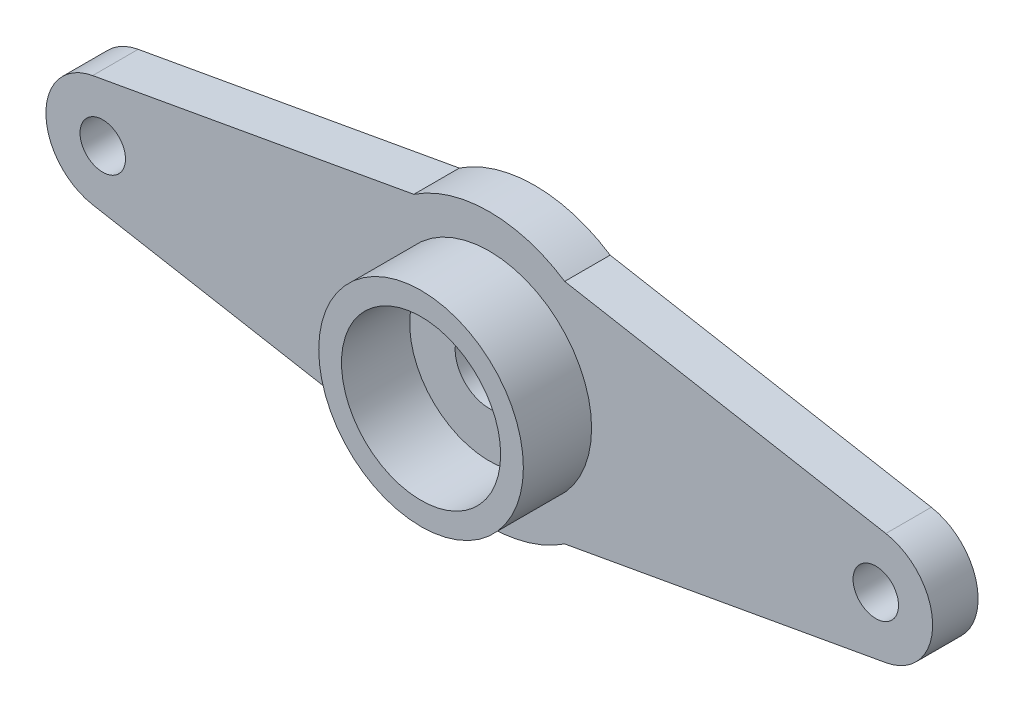
ISO-10303-21;
HEADER;
FILE_DESCRIPTION(('STEP AP214'),'2;1');
FILE_NAME('part.step','',(''),(''),'','','');
FILE_SCHEMA(('AUTOMOTIVE_DESIGN { 1 0 10303 214 1 1 1 1 }'));
ENDSEC;
DATA;
#1=APPLICATION_CONTEXT('core data for automotive mechanical design processes');
#2=APPLICATION_PROTOCOL_DEFINITION('international standard','automotive_design',2000,#1);
#3=PRODUCT_CONTEXT('',#1,'mechanical');
#4=PRODUCT('Part','Part','',(#3));
#5=PRODUCT_RELATED_PRODUCT_CATEGORY('part','',(#4));
#6=PRODUCT_DEFINITION_FORMATION('','',#4);
#7=PRODUCT_DEFINITION_CONTEXT('part definition',#1,'design');
#8=PRODUCT_DEFINITION('design','',#6,#7);
#9=PRODUCT_DEFINITION_SHAPE('','',#8);
#10=(LENGTH_UNIT() NAMED_UNIT(*) SI_UNIT(.MILLI.,.METRE.));
#11=(NAMED_UNIT(*) PLANE_ANGLE_UNIT() SI_UNIT($,.RADIAN.));
#12=(NAMED_UNIT(*) SI_UNIT($,.STERADIAN.) SOLID_ANGLE_UNIT());
#13=UNCERTAINTY_MEASURE_WITH_UNIT(LENGTH_MEASURE(1.E-05),#10,'distance_accuracy_value','');
#14=(GEOMETRIC_REPRESENTATION_CONTEXT(3) GLOBAL_UNCERTAINTY_ASSIGNED_CONTEXT((#13)) GLOBAL_UNIT_ASSIGNED_CONTEXT((#10,
#11,#12)) REPRESENTATION_CONTEXT('',''));
#15=CARTESIAN_POINT('',(0.,0.,0.));
#16=DIRECTION('',(0.,0.,1.));
#17=DIRECTION('',(1.,0.,0.));
#18=AXIS2_PLACEMENT_3D('',#15,#16,#17);
#19=CARTESIAN_POINT('',(-17.,0.,2.));
#20=DIRECTION('',(0.,0.,1.));
#21=DIRECTION('',(1.,0.,0.));
#22=AXIS2_PLACEMENT_3D('',#19,#20,#21);
#23=PLANE('',#22);
#24=CARTESIAN_POINT('',(0.,0.,2.));
#25=DIRECTION('',(0.,0.,1.));
#26=DIRECTION('',(1.,0.,0.));
#27=AXIS2_PLACEMENT_3D('',#24,#25,#26);
#28=CIRCLE('',#27,1.5);
#29=CARTESIAN_POINT('',(1.5,0.,2.));
#30=VERTEX_POINT('',#29);
#31=EDGE_CURVE('E139',#30,#30,#28,.T.);
#32=ORIENTED_EDGE('',*,*,#31,.F.);
#33=EDGE_LOOP('',(#32));
#34=FACE_BOUND('',#33,.T.);
#35=CARTESIAN_POINT('',(0.,0.,2.));
#36=DIRECTION('',(0.,0.,1.));
#37=DIRECTION('',(1.,0.,0.));
#38=AXIS2_PLACEMENT_3D('',#35,#36,#37);
#39=CIRCLE('',#38,3.5);
#40=CARTESIAN_POINT('',(3.5,0.,2.));
#41=VERTEX_POINT('',#40);
#42=EDGE_CURVE('E11',#41,#41,#39,.F.);
#43=ORIENTED_EDGE('',*,*,#42,.F.);
#44=EDGE_LOOP('',(#43));
#45=FACE_BOUND('',#44,.T.);
#46=ADVANCED_FACE('F37',(#34,#45),#23,.T.);
#47=CARTESIAN_POINT('',(-17.,0.,2.));
#48=DIRECTION('',(0.,0.,1.));
#49=DIRECTION('',(1.,0.,0.));
#50=AXIS2_PLACEMENT_3D('',#47,#48,#49);
#51=CIRCLE('',#50,1.);
#52=CARTESIAN_POINT('',(-16.,0.,2.));
#53=VERTEX_POINT('',#52);
#54=EDGE_CURVE('E209',#53,#53,#51,.T.);
#55=ORIENTED_EDGE('',*,*,#54,.F.);
#56=EDGE_LOOP('',(#55));
#57=FACE_BOUND('',#56,.T.);
#58=CARTESIAN_POINT('',(17.,0.,2.));
#59=DIRECTION('',(0.,0.,1.));
#60=DIRECTION('',(1.,0.,0.));
#61=AXIS2_PLACEMENT_3D('',#58,#59,#60);
#62=CIRCLE('',#61,1.);
#63=CARTESIAN_POINT('',(18.,0.,2.));
#64=VERTEX_POINT('',#63);
#65=EDGE_CURVE('E206',#64,#64,#62,.T.);
#66=ORIENTED_EDGE('',*,*,#65,.F.);
#67=EDGE_LOOP('',(#66));
#68=FACE_BOUND('',#67,.T.);
#69=CARTESIAN_POINT('',(0.,0.,2.));
#70=DIRECTION('',(0.,0.,1.));
#71=DIRECTION('',(1.,0.,0.));
#72=AXIS2_PLACEMENT_3D('',#69,#70,#71);
#73=CIRCLE('',#72,4.5);
#74=CARTESIAN_POINT('',(4.5,0.,2.));
#75=VERTEX_POINT('',#74);
#76=EDGE_CURVE('E194',#75,#75,#73,.T.);
#77=ORIENTED_EDGE('',*,*,#76,.F.);
#78=EDGE_LOOP('',(#77));
#79=FACE_BOUND('',#78,.T.);
#80=CARTESIAN_POINT('',(-17.,0.,2.));
#81=DIRECTION('',(0.,0.,1.));
#82=DIRECTION('',(1.,0.,0.));
#83=AXIS2_PLACEMENT_3D('',#80,#81,#82);
#84=CIRCLE('',#83,2.5);
#85=CARTESIAN_POINT('',(-17.4423451636049,2.46055496915541,2.));
#86=VERTEX_POINT('',#85);
#87=CARTESIAN_POINT('',(-17.4423451636049,-2.46055496915541,2.));
#88=VERTEX_POINT('',#87);
#89=EDGE_CURVE('E150',#86,#88,#84,.T.);
#90=ORIENTED_EDGE('',*,*,#89,.T.);
#91=DIRECTION('',(0.984221987662164,-0.176938065441948,0.));
#92=VECTOR('',#91,1.);
#93=CARTESIAN_POINT('',(-17.4423451636049,-2.46055496915541,2.));
#94=LINE('',#93,#92);
#95=CARTESIAN_POINT('',(-3.3166247903554,-5.,2.));
#96=VERTEX_POINT('',#95);
#97=EDGE_CURVE('E98',#88,#96,#94,.T.);
#98=ORIENTED_EDGE('',*,*,#97,.T.);
#99=CARTESIAN_POINT('',(0.,0.,2.));
#100=DIRECTION('',(0.,0.,1.));
#101=DIRECTION('',(1.,0.,0.));
#102=AXIS2_PLACEMENT_3D('',#99,#100,#101);
#103=CIRCLE('',#102,6.);
#104=CARTESIAN_POINT('',(3.3166247903554,-5.,2.));
#105=VERTEX_POINT('',#104);
#106=EDGE_CURVE('E182',#96,#105,#103,.T.);
#107=ORIENTED_EDGE('',*,*,#106,.T.);
#108=DIRECTION('',(0.984221987662164,0.176938065441948,0.));
#109=VECTOR('',#108,1.);
#110=CARTESIAN_POINT('',(3.3166247903554,-5.,2.));
#111=LINE('',#110,#109);
#112=CARTESIAN_POINT('',(17.4423451636049,-2.4605549691554,2.));
#113=VERTEX_POINT('',#112);
#114=EDGE_CURVE('E181',#105,#113,#111,.T.);
#115=ORIENTED_EDGE('',*,*,#114,.T.);
#116=CARTESIAN_POINT('',(17.,0.,2.));
#117=DIRECTION('',(0.,0.,1.));
#118=DIRECTION('',(1.,0.,0.));
#119=AXIS2_PLACEMENT_3D('',#116,#117,#118);
#120=CIRCLE('',#119,2.5);
#121=CARTESIAN_POINT('',(17.4423451636049,2.46055496915541,2.));
#122=VERTEX_POINT('',#121);
#123=EDGE_CURVE('E117',#113,#122,#120,.T.);
#124=ORIENTED_EDGE('',*,*,#123,.T.);
#125=DIRECTION('',(-0.984221987662164,0.176938065441948,0.));
#126=VECTOR('',#125,1.);
#127=CARTESIAN_POINT('',(17.4423451636049,2.46055496915541,2.));
#128=LINE('',#127,#126);
#129=CARTESIAN_POINT('',(3.3166247903554,5.,2.));
#130=VERTEX_POINT('',#129);
#131=EDGE_CURVE('E111',#122,#130,#128,.T.);
#132=ORIENTED_EDGE('',*,*,#131,.T.);
#133=CARTESIAN_POINT('',(0.,0.,2.));
#134=DIRECTION('',(0.,0.,1.));
#135=DIRECTION('',(1.,0.,0.));
#136=AXIS2_PLACEMENT_3D('',#133,#134,#135);
#137=CIRCLE('',#136,6.);
#138=CARTESIAN_POINT('',(-3.3166247903554,5.,2.));
#139=VERTEX_POINT('',#138);
#140=EDGE_CURVE('E115',#130,#139,#137,.T.);
#141=ORIENTED_EDGE('',*,*,#140,.T.);
#142=DIRECTION('',(-0.984221987662164,-0.176938065441948,0.));
#143=VECTOR('',#142,1.);
#144=CARTESIAN_POINT('',(-17.4423451636049,2.46055496915541,2.));
#145=LINE('',#144,#143);
#146=EDGE_CURVE('E54',#139,#86,#145,.T.);
#147=ORIENTED_EDGE('',*,*,#146,.T.);
#148=EDGE_LOOP('',(#90,#98,#107,#115,#124,#132,#141,#147));
#149=FACE_BOUND('',#148,.T.);
#150=ADVANCED_FACE('F113',(#57,#68,#79,#149),#23,.T.);
#151=CARTESIAN_POINT('',(-17.,0.,0.));
#152=DIRECTION('',(0.,0.,1.));
#153=DIRECTION('',(1.,0.,0.));
#154=AXIS2_PLACEMENT_3D('',#151,#152,#153);
#155=PLANE('',#154);
#156=CARTESIAN_POINT('',(-17.,0.,0.));
#157=DIRECTION('',(0.,0.,1.));
#158=DIRECTION('',(1.,0.,0.));
#159=AXIS2_PLACEMENT_3D('',#156,#157,#158);
#160=CIRCLE('',#159,1.);
#161=CARTESIAN_POINT('',(-16.,0.,0.));
#162=VERTEX_POINT('',#161);
#163=EDGE_CURVE('E202',#162,#162,#160,.T.);
#164=ORIENTED_EDGE('',*,*,#163,.T.);
#165=EDGE_LOOP('',(#164));
#166=FACE_BOUND('',#165,.T.);
#167=CARTESIAN_POINT('',(17.,0.,0.));
#168=DIRECTION('',(0.,0.,1.));
#169=DIRECTION('',(1.,0.,0.));
#170=AXIS2_PLACEMENT_3D('',#167,#168,#169);
#171=CIRCLE('',#170,1.);
#172=CARTESIAN_POINT('',(18.,0.,0.));
#173=VERTEX_POINT('',#172);
#174=EDGE_CURVE('E203',#173,#173,#171,.T.);
#175=ORIENTED_EDGE('',*,*,#174,.T.);
#176=EDGE_LOOP('',(#175));
#177=FACE_BOUND('',#176,.T.);
#178=CARTESIAN_POINT('',(-17.,0.,0.));
#179=DIRECTION('',(0.,0.,1.));
#180=DIRECTION('',(1.,0.,0.));
#181=AXIS2_PLACEMENT_3D('',#178,#179,#180);
#182=CIRCLE('',#181,2.5);
#183=CARTESIAN_POINT('',(-17.4423451636049,2.46055496915541,0.));
#184=VERTEX_POINT('',#183);
#185=CARTESIAN_POINT('',(-17.4423451636049,-2.46055496915541,0.));
#186=VERTEX_POINT('',#185);
#187=EDGE_CURVE('E135',#184,#186,#182,.T.);
#188=ORIENTED_EDGE('',*,*,#187,.F.);
#189=DIRECTION('',(-0.984221987662164,-0.176938065441948,0.));
#190=VECTOR('',#189,1.);
#191=CARTESIAN_POINT('',(-17.4423451636049,2.46055496915541,0.));
#192=LINE('',#191,#190);
#193=CARTESIAN_POINT('',(-3.3166247903554,5.,0.));
#194=VERTEX_POINT('',#193);
#195=EDGE_CURVE('E89',#194,#184,#192,.T.);
#196=ORIENTED_EDGE('',*,*,#195,.F.);
#197=CARTESIAN_POINT('',(0.,0.,0.));
#198=DIRECTION('',(0.,0.,1.));
#199=DIRECTION('',(1.,0.,0.));
#200=AXIS2_PLACEMENT_3D('',#197,#198,#199);
#201=CIRCLE('',#200,6.);
#202=CARTESIAN_POINT('',(3.3166247903554,5.,0.));
#203=VERTEX_POINT('',#202);
#204=EDGE_CURVE('E83',#203,#194,#201,.T.);
#205=ORIENTED_EDGE('',*,*,#204,.F.);
#206=DIRECTION('',(-0.984221987662164,0.176938065441948,0.));
#207=VECTOR('',#206,1.);
#208=CARTESIAN_POINT('',(17.4423451636049,2.46055496915541,0.));
#209=LINE('',#208,#207);
#210=CARTESIAN_POINT('',(17.4423451636049,2.46055496915541,0.));
#211=VERTEX_POINT('',#210);
#212=EDGE_CURVE('E125',#211,#203,#209,.T.);
#213=ORIENTED_EDGE('',*,*,#212,.F.);
#214=CARTESIAN_POINT('',(17.,0.,0.));
#215=DIRECTION('',(0.,0.,1.));
#216=DIRECTION('',(1.,0.,0.));
#217=AXIS2_PLACEMENT_3D('',#214,#215,#216);
#218=CIRCLE('',#217,2.5);
#219=CARTESIAN_POINT('',(17.4423451636049,-2.4605549691554,0.));
#220=VERTEX_POINT('',#219);
#221=EDGE_CURVE('E145',#220,#211,#218,.T.);
#222=ORIENTED_EDGE('',*,*,#221,.F.);
#223=DIRECTION('',(0.984221987662164,0.176938065441948,0.));
#224=VECTOR('',#223,1.);
#225=CARTESIAN_POINT('',(3.3166247903554,-5.,0.));
#226=LINE('',#225,#224);
#227=CARTESIAN_POINT('',(3.3166247903554,-5.,0.));
#228=VERTEX_POINT('',#227);
#229=EDGE_CURVE('E143',#228,#220,#226,.T.);
#230=ORIENTED_EDGE('',*,*,#229,.F.);
#231=CARTESIAN_POINT('',(0.,0.,0.));
#232=DIRECTION('',(0.,0.,1.));
#233=DIRECTION('',(1.,0.,0.));
#234=AXIS2_PLACEMENT_3D('',#231,#232,#233);
#235=CIRCLE('',#234,6.);
#236=CARTESIAN_POINT('',(-3.3166247903554,-5.,0.));
#237=VERTEX_POINT('',#236);
#238=EDGE_CURVE('E141',#237,#228,#235,.T.);
#239=ORIENTED_EDGE('',*,*,#238,.F.);
#240=DIRECTION('',(0.984221987662164,-0.176938065441948,0.));
#241=VECTOR('',#240,1.);
#242=CARTESIAN_POINT('',(-17.4423451636049,-2.46055496915541,0.));
#243=LINE('',#242,#241);
#244=EDGE_CURVE('E138',#186,#237,#243,.T.);
#245=ORIENTED_EDGE('',*,*,#244,.F.);
#246=EDGE_LOOP('',(#188,#196,#205,#213,#222,#230,#239,#245));
#247=FACE_BOUND('',#246,.T.);
#248=CARTESIAN_POINT('',(0.,0.,0.));
#249=DIRECTION('',(0.,0.,1.));
#250=DIRECTION('',(1.,0.,0.));
#251=AXIS2_PLACEMENT_3D('',#248,#249,#250);
#252=CIRCLE('',#251,1.5);
#253=CARTESIAN_POINT('',(1.5,0.,0.));
#254=VERTEX_POINT('',#253);
#255=EDGE_CURVE('E188',#254,#254,#252,.T.);
#256=ORIENTED_EDGE('',*,*,#255,.T.);
#257=EDGE_LOOP('',(#256));
#258=FACE_BOUND('',#257,.T.);
#259=ADVANCED_FACE('F168',(#166,#177,#247,#258),#155,.F.);
#260=CARTESIAN_POINT('',(-17.,0.,2.));
#261=DIRECTION('',(0.,0.,-1.));
#262=DIRECTION('',(-1.,0.,0.));
#263=AXIS2_PLACEMENT_3D('',#260,#261,#262);
#264=CYLINDRICAL_SURFACE('',#263,2.5);
#265=ORIENTED_EDGE('',*,*,#187,.T.);
#266=DIRECTION('',(0.,0.,-1.));
#267=VECTOR('',#266,1.);
#268=CARTESIAN_POINT('',(-17.4423451636049,-2.46055496915541,2.));
#269=LINE('',#268,#267);
#270=EDGE_CURVE('E46',#88,#186,#269,.T.);
#271=ORIENTED_EDGE('',*,*,#270,.F.);
#272=ORIENTED_EDGE('',*,*,#89,.F.);
#273=DIRECTION('',(0.,0.,-1.));
#274=VECTOR('',#273,1.);
#275=CARTESIAN_POINT('',(-17.4423451636049,2.46055496915541,2.));
#276=LINE('',#275,#274);
#277=EDGE_CURVE('E131',#86,#184,#276,.T.);
#278=ORIENTED_EDGE('',*,*,#277,.T.);
#279=EDGE_LOOP('',(#265,#271,#272,#278));
#280=FACE_BOUND('',#279,.T.);
#281=ADVANCED_FACE('F39',(#280),#264,.T.);
#282=CARTESIAN_POINT('',(-17.4423451636049,-2.46055496915541,2.));
#283=DIRECTION('',(0.176938065441948,0.984221987662164,0.));
#284=DIRECTION('',(-0.984221987662164,0.176938065441948,0.));
#285=AXIS2_PLACEMENT_3D('',#282,#283,#284);
#286=PLANE('',#285);
#287=ORIENTED_EDGE('',*,*,#244,.T.);
#288=DIRECTION('',(0.,0.,-1.));
#289=VECTOR('',#288,1.);
#290=CARTESIAN_POINT('',(-3.3166247903554,-5.,2.));
#291=LINE('',#290,#289);
#292=EDGE_CURVE('E160',#96,#237,#291,.T.);
#293=ORIENTED_EDGE('',*,*,#292,.F.);
#294=ORIENTED_EDGE('',*,*,#97,.F.);
#295=ORIENTED_EDGE('',*,*,#270,.T.);
#296=EDGE_LOOP('',(#287,#293,#294,#295));
#297=FACE_BOUND('',#296,.T.);
#298=ADVANCED_FACE('F163',(#297),#286,.F.);
#299=CARTESIAN_POINT('',(0.,0.,2.));
#300=DIRECTION('',(0.,0.,-1.));
#301=DIRECTION('',(-1.,0.,0.));
#302=AXIS2_PLACEMENT_3D('',#299,#300,#301);
#303=CYLINDRICAL_SURFACE('',#302,6.);
#304=ORIENTED_EDGE('',*,*,#238,.T.);
#305=DIRECTION('',(0.,0.,-1.));
#306=VECTOR('',#305,1.);
#307=CARTESIAN_POINT('',(3.3166247903554,-5.,2.));
#308=LINE('',#307,#306);
#309=EDGE_CURVE('E157',#105,#228,#308,.T.);
#310=ORIENTED_EDGE('',*,*,#309,.F.);
#311=ORIENTED_EDGE('',*,*,#106,.F.);
#312=ORIENTED_EDGE('',*,*,#292,.T.);
#313=EDGE_LOOP('',(#304,#310,#311,#312));
#314=FACE_BOUND('',#313,.T.);
#315=ADVANCED_FACE('F175',(#314),#303,.T.);
#316=CARTESIAN_POINT('',(3.3166247903554,-5.,2.));
#317=DIRECTION('',(-0.176938065441948,0.984221987662164,0.));
#318=DIRECTION('',(-0.984221987662164,-0.176938065441948,0.));
#319=AXIS2_PLACEMENT_3D('',#316,#317,#318);
#320=PLANE('',#319);
#321=ORIENTED_EDGE('',*,*,#229,.T.);
#322=DIRECTION('',(0.,0.,-1.));
#323=VECTOR('',#322,1.);
#324=CARTESIAN_POINT('',(17.4423451636049,-2.4605549691554,2.));
#325=LINE('',#324,#323);
#326=EDGE_CURVE('E154',#113,#220,#325,.T.);
#327=ORIENTED_EDGE('',*,*,#326,.F.);
#328=ORIENTED_EDGE('',*,*,#114,.F.);
#329=ORIENTED_EDGE('',*,*,#309,.T.);
#330=EDGE_LOOP('',(#321,#327,#328,#329));
#331=FACE_BOUND('',#330,.T.);
#332=ADVANCED_FACE('F179',(#331),#320,.F.);
#333=CARTESIAN_POINT('',(17.,0.,2.));
#334=DIRECTION('',(0.,0.,-1.));
#335=DIRECTION('',(-1.,0.,0.));
#336=AXIS2_PLACEMENT_3D('',#333,#334,#335);
#337=CYLINDRICAL_SURFACE('',#336,2.5);
#338=ORIENTED_EDGE('',*,*,#221,.T.);
#339=DIRECTION('',(0.,0.,-1.));
#340=VECTOR('',#339,1.);
#341=CARTESIAN_POINT('',(17.4423451636049,2.46055496915541,2.));
#342=LINE('',#341,#340);
#343=EDGE_CURVE('E126',#122,#211,#342,.T.);
#344=ORIENTED_EDGE('',*,*,#343,.F.);
#345=ORIENTED_EDGE('',*,*,#123,.F.);
#346=ORIENTED_EDGE('',*,*,#326,.T.);
#347=EDGE_LOOP('',(#338,#344,#345,#346));
#348=FACE_BOUND('',#347,.T.);
#349=ADVANCED_FACE('F264',(#348),#337,.T.);
#350=CARTESIAN_POINT('',(17.4423451636049,2.46055496915541,2.));
#351=DIRECTION('',(-0.176938065441948,-0.984221987662164,0.));
#352=DIRECTION('',(0.984221987662164,-0.176938065441948,0.));
#353=AXIS2_PLACEMENT_3D('',#350,#351,#352);
#354=PLANE('',#353);
#355=ORIENTED_EDGE('',*,*,#212,.T.);
#356=DIRECTION('',(0.,0.,-1.));
#357=VECTOR('',#356,1.);
#358=CARTESIAN_POINT('',(3.3166247903554,5.,2.));
#359=LINE('',#358,#357);
#360=EDGE_CURVE('E122',#130,#203,#359,.T.);
#361=ORIENTED_EDGE('',*,*,#360,.F.);
#362=ORIENTED_EDGE('',*,*,#131,.F.);
#363=ORIENTED_EDGE('',*,*,#343,.T.);
#364=EDGE_LOOP('',(#355,#361,#362,#363));
#365=FACE_BOUND('',#364,.T.);
#366=ADVANCED_FACE('F123',(#365),#354,.F.);
#367=CARTESIAN_POINT('',(0.,0.,2.));
#368=DIRECTION('',(0.,0.,-1.));
#369=DIRECTION('',(-1.,0.,0.));
#370=AXIS2_PLACEMENT_3D('',#367,#368,#369);
#371=CYLINDRICAL_SURFACE('',#370,6.);
#372=ORIENTED_EDGE('',*,*,#204,.T.);
#373=DIRECTION('',(0.,0.,-1.));
#374=VECTOR('',#373,1.);
#375=CARTESIAN_POINT('',(-3.3166247903554,5.,2.));
#376=LINE('',#375,#374);
#377=EDGE_CURVE('E127',#139,#194,#376,.T.);
#378=ORIENTED_EDGE('',*,*,#377,.F.);
#379=ORIENTED_EDGE('',*,*,#140,.F.);
#380=ORIENTED_EDGE('',*,*,#360,.T.);
#381=EDGE_LOOP('',(#372,#378,#379,#380));
#382=FACE_BOUND('',#381,.T.);
#383=ADVANCED_FACE('F129',(#382),#371,.T.);
#384=CARTESIAN_POINT('',(-17.4423451636049,2.46055496915541,2.));
#385=DIRECTION('',(0.176938065441948,-0.984221987662164,0.));
#386=DIRECTION('',(0.984221987662164,0.176938065441948,0.));
#387=AXIS2_PLACEMENT_3D('',#384,#385,#386);
#388=PLANE('',#387);
#389=ORIENTED_EDGE('',*,*,#195,.T.);
#390=ORIENTED_EDGE('',*,*,#277,.F.);
#391=ORIENTED_EDGE('',*,*,#146,.F.);
#392=ORIENTED_EDGE('',*,*,#377,.T.);
#393=EDGE_LOOP('',(#389,#390,#391,#392));
#394=FACE_BOUND('',#393,.T.);
#395=ADVANCED_FACE('F257',(#394),#388,.F.);
#396=CARTESIAN_POINT('',(0.,0.,2.));
#397=DIRECTION('',(0.,0.,-1.));
#398=DIRECTION('',(-1.,0.,0.));
#399=AXIS2_PLACEMENT_3D('',#396,#397,#398);
#400=CYLINDRICAL_SURFACE('',#399,1.5);
#401=ORIENTED_EDGE('',*,*,#31,.T.);
#402=EDGE_LOOP('',(#401));
#403=FACE_BOUND('',#402,.T.);
#404=ORIENTED_EDGE('',*,*,#255,.F.);
#405=EDGE_LOOP('',(#404));
#406=FACE_BOUND('',#405,.T.);
#407=ADVANCED_FACE('F243',(#403,#406),#400,.F.);
#408=CARTESIAN_POINT('',(0.,0.,5.));
#409=DIRECTION('',(0.,0.,1.));
#410=DIRECTION('',(1.,0.,0.));
#411=AXIS2_PLACEMENT_3D('',#408,#409,#410);
#412=PLANE('',#411);
#413=CARTESIAN_POINT('',(0.,0.,5.));
#414=DIRECTION('',(0.,0.,1.));
#415=DIRECTION('',(1.,0.,0.));
#416=AXIS2_PLACEMENT_3D('',#413,#414,#415);
#417=CIRCLE('',#416,4.5);
#418=CARTESIAN_POINT('',(4.5,0.,5.));
#419=VERTEX_POINT('',#418);
#420=EDGE_CURVE('E191',#419,#419,#417,.T.);
#421=ORIENTED_EDGE('',*,*,#420,.T.);
#422=EDGE_LOOP('',(#421));
#423=FACE_BOUND('',#422,.T.);
#424=CARTESIAN_POINT('',(0.,0.,5.));
#425=DIRECTION('',(0.,0.,1.));
#426=DIRECTION('',(1.,0.,0.));
#427=AXIS2_PLACEMENT_3D('',#424,#425,#426);
#428=CIRCLE('',#427,3.5);
#429=CARTESIAN_POINT('',(3.5,0.,5.));
#430=VERTEX_POINT('',#429);
#431=EDGE_CURVE('E197',#430,#430,#428,.T.);
#432=ORIENTED_EDGE('',*,*,#431,.F.);
#433=EDGE_LOOP('',(#432));
#434=FACE_BOUND('',#433,.T.);
#435=ADVANCED_FACE('F234',(#423,#434),#412,.T.);
#436=CARTESIAN_POINT('',(0.,0.,5.));
#437=DIRECTION('',(0.,0.,-1.));
#438=DIRECTION('',(-1.,0.,0.));
#439=AXIS2_PLACEMENT_3D('',#436,#437,#438);
#440=CYLINDRICAL_SURFACE('',#439,4.5);
#441=ORIENTED_EDGE('',*,*,#420,.F.);
#442=EDGE_LOOP('',(#441));
#443=FACE_BOUND('',#442,.T.);
#444=ORIENTED_EDGE('',*,*,#76,.T.);
#445=EDGE_LOOP('',(#444));
#446=FACE_BOUND('',#445,.T.);
#447=ADVANCED_FACE('F231',(#443,#446),#440,.T.);
#448=CARTESIAN_POINT('',(0.,0.,5.));
#449=DIRECTION('',(0.,0.,-1.));
#450=DIRECTION('',(-1.,0.,0.));
#451=AXIS2_PLACEMENT_3D('',#448,#449,#450);
#452=CYLINDRICAL_SURFACE('',#451,3.5);
#453=ORIENTED_EDGE('',*,*,#431,.T.);
#454=EDGE_LOOP('',(#453));
#455=FACE_BOUND('',#454,.T.);
#456=ORIENTED_EDGE('',*,*,#42,.T.);
#457=EDGE_LOOP('',(#456));
#458=FACE_BOUND('',#457,.T.);
#459=ADVANCED_FACE('F233',(#455,#458),#452,.F.);
#460=CARTESIAN_POINT('',(17.,0.,0.));
#461=DIRECTION('',(0.,0.,1.));
#462=DIRECTION('',(1.,0.,0.));
#463=AXIS2_PLACEMENT_3D('',#460,#461,#462);
#464=CYLINDRICAL_SURFACE('',#463,1.);
#465=ORIENTED_EDGE('',*,*,#174,.F.);
#466=EDGE_LOOP('',(#465));
#467=FACE_BOUND('',#466,.T.);
#468=ORIENTED_EDGE('',*,*,#65,.T.);
#469=EDGE_LOOP('',(#468));
#470=FACE_BOUND('',#469,.T.);
#471=ADVANCED_FACE('F220',(#467,#470),#464,.F.);
#472=CARTESIAN_POINT('',(-17.,0.,0.));
#473=DIRECTION('',(0.,0.,1.));
#474=DIRECTION('',(1.,0.,0.));
#475=AXIS2_PLACEMENT_3D('',#472,#473,#474);
#476=CYLINDRICAL_SURFACE('',#475,1.);
#477=ORIENTED_EDGE('',*,*,#163,.F.);
#478=EDGE_LOOP('',(#477));
#479=FACE_BOUND('',#478,.T.);
#480=ORIENTED_EDGE('',*,*,#54,.T.);
#481=EDGE_LOOP('',(#480));
#482=FACE_BOUND('',#481,.T.);
#483=ADVANCED_FACE('F217',(#479,#482),#476,.F.);
#484=CLOSED_SHELL('',(#46,#150,#259,#281,#298,#315,#332,#349,#366,#383,#395,#407,#435,#447,#459,
#471,#483));
#485=MANIFOLD_SOLID_BREP('B2',#484);
#486=ADVANCED_BREP_SHAPE_REPRESENTATION('',(#18,#485),#14);
#487=SHAPE_DEFINITION_REPRESENTATION(#9,#486);
ENDSEC;
END-ISO-10303-21;
